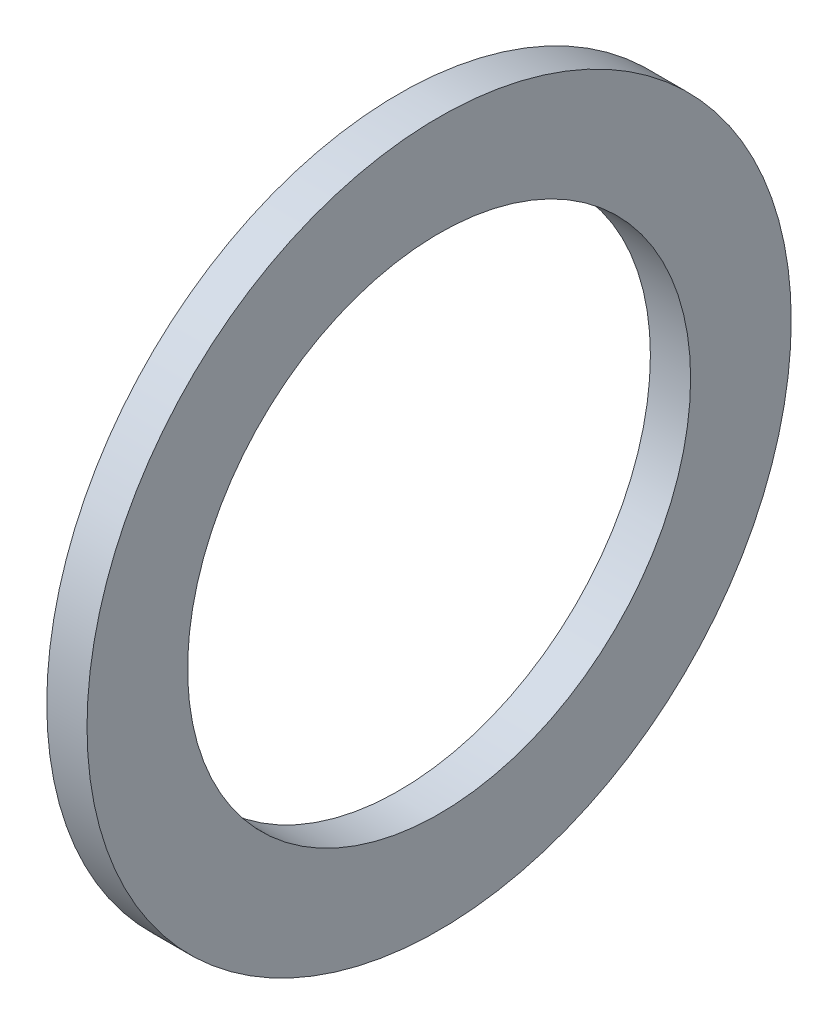
ISO-10303-21;
HEADER;
FILE_DESCRIPTION(('STEP AP214'),'2;1');
FILE_NAME('part.step','',(''),(''),'','','');
FILE_SCHEMA(('AUTOMOTIVE_DESIGN { 1 0 10303 214 1 1 1 1 }'));
ENDSEC;
DATA;
#1=APPLICATION_CONTEXT('core data for automotive mechanical design processes');
#2=APPLICATION_PROTOCOL_DEFINITION('international standard','automotive_design',2000,#1);
#3=PRODUCT_CONTEXT('',#1,'mechanical');
#4=PRODUCT('Part','Part','',(#3));
#5=PRODUCT_RELATED_PRODUCT_CATEGORY('part','',(#4));
#6=PRODUCT_DEFINITION_FORMATION('','',#4);
#7=PRODUCT_DEFINITION_CONTEXT('part definition',#1,'design');
#8=PRODUCT_DEFINITION('design','',#6,#7);
#9=PRODUCT_DEFINITION_SHAPE('','',#8);
#10=(LENGTH_UNIT() NAMED_UNIT(*) SI_UNIT(.MILLI.,.METRE.));
#11=(NAMED_UNIT(*) PLANE_ANGLE_UNIT() SI_UNIT($,.RADIAN.));
#12=(NAMED_UNIT(*) SI_UNIT($,.STERADIAN.) SOLID_ANGLE_UNIT());
#13=UNCERTAINTY_MEASURE_WITH_UNIT(LENGTH_MEASURE(1.E-05),#10,'distance_accuracy_value','');
#14=(GEOMETRIC_REPRESENTATION_CONTEXT(3) GLOBAL_UNCERTAINTY_ASSIGNED_CONTEXT((#13)) GLOBAL_UNIT_ASSIGNED_CONTEXT((#10,
#11,#12)) REPRESENTATION_CONTEXT('',''));
#15=CARTESIAN_POINT('',(0.,0.,0.));
#16=DIRECTION('',(0.,0.,1.));
#17=DIRECTION('',(1.,0.,0.));
#18=AXIS2_PLACEMENT_3D('',#15,#16,#17);
#19=CARTESIAN_POINT('',(2.,0.,0.));
#20=DIRECTION('',(1.,0.,0.));
#21=DIRECTION('',(0.,0.,-1.));
#22=AXIS2_PLACEMENT_3D('',#19,#20,#21);
#23=PLANE('',#22);
#24=CARTESIAN_POINT('',(2.,0.,0.));
#25=DIRECTION('',(1.,0.,0.));
#26=DIRECTION('',(0.,0.,-1.));
#27=AXIS2_PLACEMENT_3D('',#24,#25,#26);
#28=CIRCLE('',#27,17.5);
#29=CARTESIAN_POINT('',(2.,0.,-17.5));
#30=VERTEX_POINT('',#29);
#31=EDGE_CURVE('E10',#30,#30,#28,.T.);
#32=ORIENTED_EDGE('',*,*,#31,.T.);
#33=EDGE_LOOP('',(#32));
#34=FACE_BOUND('',#33,.T.);
#35=CARTESIAN_POINT('',(2.,0.,0.));
#36=DIRECTION('',(1.,0.,0.));
#37=DIRECTION('',(0.,0.,-1.));
#38=AXIS2_PLACEMENT_3D('',#35,#36,#37);
#39=CIRCLE('',#38,12.5);
#40=CARTESIAN_POINT('',(2.,0.,-12.5));
#41=VERTEX_POINT('',#40);
#42=EDGE_CURVE('E43',#41,#41,#39,.T.);
#43=ORIENTED_EDGE('',*,*,#42,.F.);
#44=EDGE_LOOP('',(#43));
#45=FACE_BOUND('',#44,.T.);
#46=ADVANCED_FACE('F32',(#34,#45),#23,.T.);
#47=CARTESIAN_POINT('',(0.,0.,0.));
#48=DIRECTION('',(1.,0.,0.));
#49=DIRECTION('',(0.,0.,-1.));
#50=AXIS2_PLACEMENT_3D('',#47,#48,#49);
#51=PLANE('',#50);
#52=CARTESIAN_POINT('',(0.,0.,0.));
#53=DIRECTION('',(1.,0.,0.));
#54=DIRECTION('',(0.,0.,-1.));
#55=AXIS2_PLACEMENT_3D('',#52,#53,#54);
#56=CIRCLE('',#55,17.5);
#57=CARTESIAN_POINT('',(0.,0.,-17.5));
#58=VERTEX_POINT('',#57);
#59=EDGE_CURVE('E36',#58,#58,#56,.T.);
#60=ORIENTED_EDGE('',*,*,#59,.F.);
#61=EDGE_LOOP('',(#60));
#62=FACE_BOUND('',#61,.T.);
#63=CARTESIAN_POINT('',(0.,0.,0.));
#64=DIRECTION('',(1.,0.,0.));
#65=DIRECTION('',(0.,0.,-1.));
#66=AXIS2_PLACEMENT_3D('',#63,#64,#65);
#67=CIRCLE('',#66,12.5);
#68=CARTESIAN_POINT('',(0.,0.,-12.5));
#69=VERTEX_POINT('',#68);
#70=EDGE_CURVE('E45',#69,#69,#67,.T.);
#71=ORIENTED_EDGE('',*,*,#70,.T.);
#72=EDGE_LOOP('',(#71));
#73=FACE_BOUND('',#72,.T.);
#74=ADVANCED_FACE('F55',(#62,#73),#51,.F.);
#75=CARTESIAN_POINT('',(2.,0.,0.));
#76=DIRECTION('',(-1.,0.,0.));
#77=DIRECTION('',(0.,0.,1.));
#78=AXIS2_PLACEMENT_3D('',#75,#76,#77);
#79=CYLINDRICAL_SURFACE('',#78,17.5);
#80=ORIENTED_EDGE('',*,*,#31,.F.);
#81=EDGE_LOOP('',(#80));
#82=FACE_BOUND('',#81,.T.);
#83=ORIENTED_EDGE('',*,*,#59,.T.);
#84=EDGE_LOOP('',(#83));
#85=FACE_BOUND('',#84,.T.);
#86=ADVANCED_FACE('F34',(#82,#85),#79,.T.);
#87=CARTESIAN_POINT('',(2.,0.,0.));
#88=DIRECTION('',(-1.,0.,0.));
#89=DIRECTION('',(0.,0.,1.));
#90=AXIS2_PLACEMENT_3D('',#87,#88,#89);
#91=CYLINDRICAL_SURFACE('',#90,12.5);
#92=ORIENTED_EDGE('',*,*,#42,.T.);
#93=EDGE_LOOP('',(#92));
#94=FACE_BOUND('',#93,.T.);
#95=ORIENTED_EDGE('',*,*,#70,.F.);
#96=EDGE_LOOP('',(#95));
#97=FACE_BOUND('',#96,.T.);
#98=ADVANCED_FACE('F51',(#94,#97),#91,.F.);
#99=CLOSED_SHELL('',(#46,#74,#86,#98));
#100=MANIFOLD_SOLID_BREP('B2',#99);
#101=ADVANCED_BREP_SHAPE_REPRESENTATION('',(#18,#100),#14);
#102=SHAPE_DEFINITION_REPRESENTATION(#9,#101);
ENDSEC;
END-ISO-10303-21;
